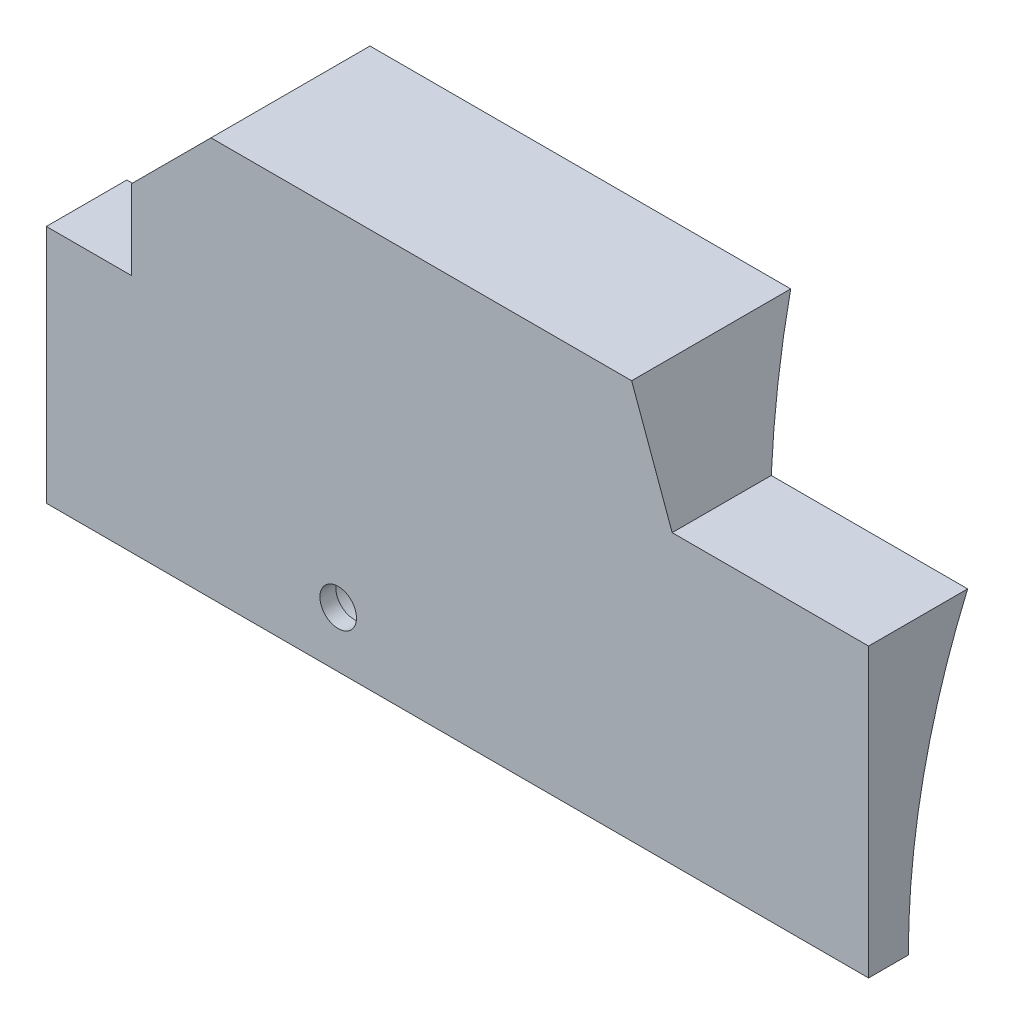
ISO-10303-21;
HEADER;
FILE_DESCRIPTION(('STEP AP214'),'2;1');
FILE_NAME('part.step','',(''),(''),'','','');
FILE_SCHEMA(('AUTOMOTIVE_DESIGN { 1 0 10303 214 1 1 1 1 }'));
ENDSEC;
DATA;
#1=APPLICATION_CONTEXT('core data for automotive mechanical design processes');
#2=APPLICATION_PROTOCOL_DEFINITION('international standard','automotive_design',2000,#1);
#3=PRODUCT_CONTEXT('',#1,'mechanical');
#4=PRODUCT('Part','Part','',(#3));
#5=PRODUCT_RELATED_PRODUCT_CATEGORY('part','',(#4));
#6=PRODUCT_DEFINITION_FORMATION('','',#4);
#7=PRODUCT_DEFINITION_CONTEXT('part definition',#1,'design');
#8=PRODUCT_DEFINITION('design','',#6,#7);
#9=PRODUCT_DEFINITION_SHAPE('','',#8);
#10=(LENGTH_UNIT() NAMED_UNIT(*) SI_UNIT(.MILLI.,.METRE.));
#11=(NAMED_UNIT(*) PLANE_ANGLE_UNIT() SI_UNIT($,.RADIAN.));
#12=(NAMED_UNIT(*) SI_UNIT($,.STERADIAN.) SOLID_ANGLE_UNIT());
#13=UNCERTAINTY_MEASURE_WITH_UNIT(LENGTH_MEASURE(1.E-05),#10,'distance_accuracy_value','');
#14=(GEOMETRIC_REPRESENTATION_CONTEXT(3) GLOBAL_UNCERTAINTY_ASSIGNED_CONTEXT((#13)) GLOBAL_UNIT_ASSIGNED_CONTEXT((#10,
#11,#12)) REPRESENTATION_CONTEXT('',''));
#15=CARTESIAN_POINT('',(0.,0.,0.));
#16=DIRECTION('',(0.,0.,1.));
#17=DIRECTION('',(1.,0.,0.));
#18=AXIS2_PLACEMENT_3D('',#15,#16,#17);
#19=CARTESIAN_POINT('',(19.999999999998,43.4250980548058,0.));
#20=DIRECTION('',(0.,0.,-1.));
#21=DIRECTION('',(1.,0.,0.));
#22=AXIS2_PLACEMENT_3D('',#19,#20,#21);
#23=CYLINDRICAL_SURFACE('',#22,1.15000000000313);
#24=CARTESIAN_POINT('',(19.999999999998,43.4250980548058,0.));
#25=DIRECTION('',(0.,0.,1.));
#26=DIRECTION('',(1.,0.,0.));
#27=AXIS2_PLACEMENT_3D('',#24,#25,#26);
#28=CIRCLE('',#27,1.15000000000313);
#29=CARTESIAN_POINT('',(21.1500000000011,43.4250980548058,0.));
#30=VERTEX_POINT('',#29);
#31=EDGE_CURVE('E240',#30,#30,#28,.T.);
#32=ORIENTED_EDGE('',*,*,#31,.T.);
#33=EDGE_LOOP('',(#32));
#34=FACE_BOUND('',#33,.T.);
#35=CARTESIAN_POINT('',(19.999999999998,43.4250980548058,-1.));
#36=DIRECTION('',(0.,0.,1.));
#37=DIRECTION('',(1.,0.,0.));
#38=AXIS2_PLACEMENT_3D('',#35,#36,#37);
#39=CIRCLE('',#38,1.15000000000313);
#40=CARTESIAN_POINT('',(21.1500000000011,43.4250980548058,-1.));
#41=VERTEX_POINT('',#40);
#42=EDGE_CURVE('E47',#41,#41,#39,.F.);
#43=ORIENTED_EDGE('',*,*,#42,.T.);
#44=EDGE_LOOP('',(#43));
#45=FACE_BOUND('',#44,.T.);
#46=ADVANCED_FACE('F43',(#34,#45),#23,.F.);
#47=CARTESIAN_POINT('',(1.6500000000003,39.9250980548054,-48.1667138374092));
#48=DIRECTION('',(1.,0.,0.));
#49=DIRECTION('',(0.,0.,1.));
#50=AXIS2_PLACEMENT_3D('',#47,#48,#49);
#51=CYLINDRICAL_SURFACE('',#50,45.6667138374092);
#52=CARTESIAN_POINT('',(47.578726295331,39.9250980548054,-48.1667138374092));
#53=DIRECTION('',(0.939692620785907,0.342020143325673,0.));
#54=DIRECTION('',(0.342020143325673,-0.939692620785907,0.));
#55=AXIS2_PLACEMENT_3D('',#52,#53,#54);
#56=ELLIPSE('',#55,48.5975018077892,45.6667138374092);
#57=CARTESIAN_POINT('',(38.4522083601362,65.0000000000003,-10.));
#58=VERTEX_POINT('',#57);
#59=CARTESIAN_POINT('',(40.9999999999997,58.0000000000003,-6.22930008334694));
#60=VERTEX_POINT('',#59);
#61=EDGE_CURVE('E197',#58,#60,#56,.T.);
#62=ORIENTED_EDGE('',*,*,#61,.T.);
#63=DIRECTION('',(1.,0.,0.));
#64=VECTOR('',#63,1.);
#65=CARTESIAN_POINT('',(1.65000000000039,58.0000000000005,-6.22930008334702));
#66=LINE('',#65,#64);
#67=CARTESIAN_POINT('',(53.3499999999999,58.0000000000002,-6.22930008334691));
#68=VERTEX_POINT('',#67);
#69=EDGE_CURVE('E194',#60,#68,#66,.T.);
#70=ORIENTED_EDGE('',*,*,#69,.T.);
#71=CARTESIAN_POINT('',(53.3499999999999,39.9250980548054,-48.1667138374092));
#72=DIRECTION('',(-1.,0.,0.));
#73=DIRECTION('',(0.,0.,-1.));
#74=AXIS2_PLACEMENT_3D('',#71,#72,#73);
#75=CIRCLE('',#74,45.6667138374092);
#76=CARTESIAN_POINT('',(53.3499999999999,39.9250980548059,-2.5));
#77=VERTEX_POINT('',#76);
#78=EDGE_CURVE('E219',#77,#68,#75,.T.);
#79=ORIENTED_EDGE('',*,*,#78,.F.);
#80=DIRECTION('',(1.,0.,0.));
#81=VECTOR('',#80,1.);
#82=CARTESIAN_POINT('',(1.6500000000003,39.9250980548059,-2.5));
#83=LINE('',#82,#81);
#84=CARTESIAN_POINT('',(1.6500000000003,39.9250980548059,-2.5));
#85=VERTEX_POINT('',#84);
#86=EDGE_CURVE('E221',#85,#77,#83,.T.);
#87=ORIENTED_EDGE('',*,*,#86,.F.);
#88=CARTESIAN_POINT('',(1.6500000000003,39.9250980548054,-48.1667138374092));
#89=DIRECTION('',(-1.,0.,0.));
#90=DIRECTION('',(0.,0.,-1.));
#91=AXIS2_PLACEMENT_3D('',#88,#89,#90);
#92=CIRCLE('',#91,45.6667138374092);
#93=CARTESIAN_POINT('',(1.6500000000003,55.0000000000001,-5.05991525469622));
#94=VERTEX_POINT('',#93);
#95=EDGE_CURVE('E118',#85,#94,#92,.T.);
#96=ORIENTED_EDGE('',*,*,#95,.T.);
#97=DIRECTION('',(1.,0.,0.));
#98=VECTOR('',#97,1.);
#99=CARTESIAN_POINT('',(1.65000000000011,55.0000000000001,-5.05991525469622));
#100=LINE('',#99,#98);
#101=CARTESIAN_POINT('',(6.99999999999924,55.0000000000001,-5.05991525469622));
#102=VERTEX_POINT('',#101);
#103=EDGE_CURVE('E222',#94,#102,#100,.T.);
#104=ORIENTED_EDGE('',*,*,#103,.T.);
#105=CARTESIAN_POINT('',(6.9999999999993,39.9250980548054,-48.1667138374092));
#106=DIRECTION('',(-1.,0.,0.));
#107=DIRECTION('',(0.,1.,0.));
#108=AXIS2_PLACEMENT_3D('',#105,#106,#107);
#109=CIRCLE('',#108,45.6667138374092);
#110=CARTESIAN_POINT('',(6.99999999999923,60.0000000000001,-7.14907050434291));
#111=VERTEX_POINT('',#110);
#112=EDGE_CURVE('E232',#102,#111,#109,.T.);
#113=ORIENTED_EDGE('',*,*,#112,.T.);
#114=CARTESIAN_POINT('',(-13.0749019451952,39.9250980548054,-48.1667138374092));
#115=DIRECTION('',(-0.707106781186552,0.707106781186543,0.));
#116=DIRECTION('',(0.707106781186543,0.707106781186552,0.));
#117=AXIS2_PLACEMENT_3D('',#114,#115,#116);
#118=ELLIPSE('',#117,64.5824860578748,45.6667138374092);
#119=CARTESIAN_POINT('',(11.9999999999992,65.0000000000003,-10.));
#120=VERTEX_POINT('',#119);
#121=EDGE_CURVE('E235',#111,#120,#118,.T.);
#122=ORIENTED_EDGE('',*,*,#121,.T.);
#123=DIRECTION('',(-1.,0.,0.));
#124=VECTOR('',#123,1.);
#125=CARTESIAN_POINT('',(38.4522083601362,65.0000000000003,-10.));
#126=LINE('',#125,#124);
#127=EDGE_CURVE('E105',#58,#120,#126,.T.);
#128=ORIENTED_EDGE('',*,*,#127,.F.);
#129=EDGE_LOOP('',(#62,#70,#79,#87,#96,#104,#113,#122,#128));
#130=FACE_BOUND('',#129,.T.);
#131=CARTESIAN_POINT('',(17.9499999999963,43.4250980548061,-2.6343214918733));
#132=CARTESIAN_POINT('',(17.9500050023373,43.3100084166059,-2.62547535582466));
#133=CARTESIAN_POINT('',(17.9597237788177,43.1948045627664,-2.61706281856671));
#134=CARTESIAN_POINT('',(17.9983947787586,42.9675002376139,-2.60131508514162));
#135=CARTESIAN_POINT('',(18.027368974417,42.8554034641616,-2.59398113142669));
#136=CARTESIAN_POINT('',(18.1037642605047,42.63763754753,-2.5805012212643));
#137=CARTESIAN_POINT('',(18.1511789861406,42.5319662011351,-2.57435485601223));
#138=CARTESIAN_POINT('',(18.263119527637,42.3300787945935,-2.56325941946487));
#139=CARTESIAN_POINT('',(18.3276412196049,42.2338604633062,-2.55831006016233));
#140=CARTESIAN_POINT('',(18.4718455436148,42.0537753901684,-2.5495502592139));
#141=CARTESIAN_POINT('',(18.5515006309596,41.9698866913654,-2.54573778020532));
#142=CARTESIAN_POINT('',(18.7237924855824,41.8166559784288,-2.53912723959167));
#143=CARTESIAN_POINT('',(18.8164296630677,41.7473144241279,-2.53632921005114));
#144=CARTESIAN_POINT('',(19.0119453773351,41.6252323285552,-2.53161727526276));
#145=CARTESIAN_POINT('',(19.114812878109,41.5724741482005,-2.52970242958649));
#146=CARTESIAN_POINT('',(19.3279513209648,41.48496351137,-2.52662728256245));
#147=CARTESIAN_POINT('',(19.4382222420517,41.4502110038353,-2.52546697907501));
#148=CARTESIAN_POINT('',(19.6630259012623,41.3997044780883,-2.52380711738491));
#149=CARTESIAN_POINT('',(19.7775582301307,41.3839486403123,-2.52330749589949));
#150=CARTESIAN_POINT('',(20.0076436738459,41.3718779478733,-2.52292325419183));
#151=CARTESIAN_POINT('',(20.1231967873756,41.3755630681305,-2.5230386331762));
#152=CARTESIAN_POINT('',(20.3520515131573,41.4022702073359,-2.52389523529696));
#153=CARTESIAN_POINT('',(20.4653529815439,41.4252934578238,-2.52463649829249));
#154=CARTESIAN_POINT('',(20.6864803342494,41.49002272825,-2.52681020674958));
#155=CARTESIAN_POINT('',(20.7943062164759,41.5317287553274,-2.52824265247525));
#156=CARTESIAN_POINT('',(21.0014174249196,41.6326327671409,-2.53190679454866));
#157=CARTESIAN_POINT('',(21.1007030456691,41.6918301483314,-2.53413846331947));
#158=CARTESIAN_POINT('',(21.2879198350759,41.8260273329879,-2.53953208434279));
#159=CARTESIAN_POINT('',(21.3758510362134,41.9010270912484,-2.54269403393408));
#160=CARTESIAN_POINT('',(21.5378648792576,42.064683004535,-2.55007628101035));
#161=CARTESIAN_POINT('',(21.6119479554051,42.1533387311869,-2.55429654529966));
#162=CARTESIAN_POINT('',(21.7441776905135,42.3417733780478,-2.56389245639614));
#163=CARTESIAN_POINT('',(21.8023243575221,42.4415522926398,-2.56926810261986));
#164=CARTESIAN_POINT('',(21.9010810078951,42.6494426620068,-2.58121687847711));
#165=CARTESIAN_POINT('',(21.941681135163,42.7575587598022,-2.58779067818787));
#166=CARTESIAN_POINT('',(22.0041773645385,42.9789943637642,-2.60209190463339));
#167=CARTESIAN_POINT('',(22.0260732911154,43.0923139187525,-2.60981934219375));
#168=CARTESIAN_POINT('',(22.0506032150165,43.3211800957494,-2.6263079802929));
#169=CARTESIAN_POINT('',(22.0531976874159,43.4367308020966,-2.63507126477244));
#170=CARTESIAN_POINT('',(22.0389824419626,43.6665696116696,-2.65338132199114));
#171=CARTESIAN_POINT('',(22.0221723104421,43.7808576879261,-2.66292811142905));
#172=CARTESIAN_POINT('',(21.9695584796998,44.0053327817185,-2.68250582505099));
#173=CARTESIAN_POINT('',(21.9336923400187,44.1155050353694,-2.69253824168283));
#174=CARTESIAN_POINT('',(21.8439487491928,44.3282492944363,-2.71264427273186));
#175=CARTESIAN_POINT('',(21.7900709631021,44.4308211584715,-2.72271788791173));
#176=CARTESIAN_POINT('',(21.6656828886919,44.6256762386579,-2.74245885439935));
#177=CARTESIAN_POINT('',(21.5951384789676,44.7179377680751,-2.75212532367861));
#178=CARTESIAN_POINT('',(21.4394503261221,44.8892985632345,-2.77053659645865));
#179=CARTESIAN_POINT('',(21.3543066751185,44.9683979120208,-2.77928140577431));
#180=CARTESIAN_POINT('',(21.1720080654509,45.1109983918766,-2.79535344888935));
#181=CARTESIAN_POINT('',(21.0748793841133,45.1745327667451,-2.80268369667963));
#182=CARTESIAN_POINT('',(20.8712116393528,45.2843652879601,-2.81552775788553));
#183=CARTESIAN_POINT('',(20.7646729285357,45.3306640798072,-2.82104163932613));
#184=CARTESIAN_POINT('',(20.5459041784511,45.4044243247551,-2.82989527519737));
#185=CARTESIAN_POINT('',(20.4337129071209,45.4319991889518,-2.83324811270189));
#186=CARTESIAN_POINT('',(20.206251530292,45.4679432730839,-2.83762876851246));
#187=CARTESIAN_POINT('',(20.0909815336902,45.4763131714062,-2.83865666894344));
#188=CARTESIAN_POINT('',(19.8613062804637,45.4736053598758,-2.83832516219519));
#189=CARTESIAN_POINT('',(19.7468997396007,45.4626336266091,-2.83697876424821));
#190=CARTESIAN_POINT('',(19.5215688033796,45.4217738963324,-2.83200610448911));
#191=CARTESIAN_POINT('',(19.410644396446,45.3918859622116,-2.82837985025666));
#192=CARTESIAN_POINT('',(19.1954081353071,45.3140734253813,-2.81906536595051));
#193=CARTESIAN_POINT('',(19.0910963286677,45.266148692946,-2.81337712104642));
#194=CARTESIAN_POINT('',(18.8919978163513,45.1536539457089,-2.8002708545562));
#195=CARTESIAN_POINT('',(18.7972110147522,45.0890840985558,-2.79285285039219));
#196=CARTESIAN_POINT('',(18.6192994060538,44.9447548880675,-2.77665892952218));
#197=CARTESIAN_POINT('',(18.5362392703513,44.8649166047775,-2.76787600402988));
#198=CARTESIAN_POINT('',(18.3846542831782,44.6925112074637,-2.74944812359641));
#199=CARTESIAN_POINT('',(18.3161334740467,44.5999405652486,-2.73980292997724));
#200=CARTESIAN_POINT('',(18.1951429586218,44.4040448818835,-2.7200688997874));
#201=CARTESIAN_POINT('',(18.1427820334092,44.3006529733375,-2.70997755794849));
#202=CARTESIAN_POINT('',(18.0562411661085,44.0866102824108,-2.68988373193522));
#203=CARTESIAN_POINT('',(18.0220402578851,43.9759680372975,-2.67988115845828));
#204=CARTESIAN_POINT('',(17.9816457315036,43.791398520619,-2.66390390152999));
#205=CARTESIAN_POINT('',(17.9697957829529,43.7186729629425,-2.65778142006822));
#206=CARTESIAN_POINT('',(17.9539713078297,43.5723465465405,-2.64582060423375));
#207=CARTESIAN_POINT('',(17.9499967989213,43.498745685852,-2.63998227049838));
#208=CARTESIAN_POINT('',(17.9499999999963,43.4250980548061,-2.6343214918733));
#209=B_SPLINE_CURVE_WITH_KNOTS('',3,(#131,#132,#133,#134,#135,#136,#137,#138,#139,#140,#141,
#142,#143,#144,#145,#146,#147,#148,#149,#150,#151,#152,#153,#154,#155,#156,#157,#158,#159,#160,
#161,#162,#163,#164,#165,#166,#167,#168,#169,#170,#171,#172,#173,#174,#175,#176,#177,#178,#179,
#180,#181,#182,#183,#184,#185,#186,#187,#188,#189,#190,#191,#192,#193,#194,#195,#196,#197,#198,
#199,#200,#201,#202,#203,#204,#205,#206,#207,#208),.UNSPECIFIED.,.T.,.F.,(4,2,2,2,2,2,2,2,2,2,2,
2,2,2,2,2,2,2,2,2,2,2,2,2,2,2,2,2,2,2,2,2,2,2,2,2,2,2,4),(0.,0.346019044668169,
0.692433608286428,1.03872871204062,1.38494041191405,1.7305278971645,2.0761263047326,
2.42135585909985,2.76658443448908,3.11177994011739,3.4569750004245,3.80219204598218,
4.14740922345405,4.49261449046919,4.83781876997521,5.18301222296668,5.52820550164098,
5.87359242819813,6.21898259602738,6.56507984905306,6.91118448032516,7.25843024415765,
7.6056824657604,7.95365186974375,8.30161907820564,8.64883648622958,8.99604088908748,
9.34112304857538,9.68619301836013,10.0293781544108,10.3725621495065,10.7157486129248,
11.0589316199224,11.4039389220374,11.7490420205002,12.0964199302148,12.4433959077125,
12.6648183239918,12.8862412369064),.UNSPECIFIED.);
#210=CARTESIAN_POINT('',(17.9499999999963,43.4250980548061,-2.6343214918733));
#211=VERTEX_POINT('',#210);
#212=EDGE_CURVE('E136',#211,#211,#209,.T.);
#213=ORIENTED_EDGE('',*,*,#212,.T.);
#214=EDGE_LOOP('',(#213));
#215=FACE_BOUND('',#214,.T.);
#216=ADVANCED_FACE('F147',(#130,#215),#51,.F.);
#217=CARTESIAN_POINT('',(53.3499999999999,46.9250980548054,-10.));
#218=DIRECTION('',(-1.,0.,0.));
#219=DIRECTION('',(0.,0.,-1.));
#220=AXIS2_PLACEMENT_3D('',#217,#218,#219);
#221=PLANE('',#220);
#222=DIRECTION('',(0.,0.,1.));
#223=VECTOR('',#222,1.);
#224=CARTESIAN_POINT('',(53.3499999999999,58.0000000000002,-10.));
#225=LINE('',#224,#223);
#226=CARTESIAN_POINT('',(53.3499999999999,58.0000000000002,0.));
#227=VERTEX_POINT('',#226);
#228=EDGE_CURVE('E11',#68,#227,#225,.T.);
#229=ORIENTED_EDGE('',*,*,#228,.T.);
#230=DIRECTION('',(0.,1.,0.));
#231=VECTOR('',#230,1.);
#232=CARTESIAN_POINT('',(53.3499999999999,46.9250980548054,0.));
#233=LINE('',#232,#231);
#234=CARTESIAN_POINT('',(53.3499999999999,39.9250980548054,0.));
#235=VERTEX_POINT('',#234);
#236=EDGE_CURVE('E220',#235,#227,#233,.T.);
#237=ORIENTED_EDGE('',*,*,#236,.F.);
#238=DIRECTION('',(0.,0.,1.));
#239=VECTOR('',#238,1.);
#240=CARTESIAN_POINT('',(53.3499999999999,39.9250980548054,-10.));
#241=LINE('',#240,#239);
#242=EDGE_CURVE('E101',#77,#235,#241,.T.);
#243=ORIENTED_EDGE('',*,*,#242,.F.);
#244=ORIENTED_EDGE('',*,*,#78,.T.);
#245=EDGE_LOOP('',(#229,#237,#243,#244));
#246=FACE_BOUND('',#245,.T.);
#247=ADVANCED_FACE('F45',(#246),#221,.F.);
#248=CARTESIAN_POINT('',(53.3499999999999,58.0000000000002,-10.));
#249=DIRECTION('',(0.,-1.,0.));
#250=DIRECTION('',(1.,0.,0.));
#251=AXIS2_PLACEMENT_3D('',#248,#249,#250);
#252=PLANE('',#251);
#253=DIRECTION('',(0.,0.,1.));
#254=VECTOR('',#253,1.);
#255=CARTESIAN_POINT('',(40.9999999999997,58.0000000000003,-10.));
#256=LINE('',#255,#254);
#257=CARTESIAN_POINT('',(40.9999999999997,58.0000000000003,0.));
#258=VERTEX_POINT('',#257);
#259=EDGE_CURVE('E53',#60,#258,#256,.T.);
#260=ORIENTED_EDGE('',*,*,#259,.T.);
#261=DIRECTION('',(-1.,0.,0.));
#262=VECTOR('',#261,1.);
#263=CARTESIAN_POINT('',(53.3499999999999,58.0000000000002,0.));
#264=LINE('',#263,#262);
#265=EDGE_CURVE('E192',#227,#258,#264,.T.);
#266=ORIENTED_EDGE('',*,*,#265,.F.);
#267=ORIENTED_EDGE('',*,*,#228,.F.);
#268=ORIENTED_EDGE('',*,*,#69,.F.);
#269=EDGE_LOOP('',(#260,#266,#267,#268));
#270=FACE_BOUND('',#269,.T.);
#271=ADVANCED_FACE('F180',(#270),#252,.F.);
#272=CARTESIAN_POINT('',(40.9999999999997,58.0000000000003,-10.));
#273=DIRECTION('',(-0.939692620785907,-0.342020143325673,0.));
#274=DIRECTION('',(0.342020143325673,-0.939692620785907,0.));
#275=AXIS2_PLACEMENT_3D('',#272,#273,#274);
#276=PLANE('',#275);
#277=DIRECTION('',(0.,0.,1.));
#278=VECTOR('',#277,1.);
#279=CARTESIAN_POINT('',(38.4522083601362,65.0000000000003,-10.));
#280=LINE('',#279,#278);
#281=CARTESIAN_POINT('',(38.4522083601362,65.0000000000003,0.));
#282=VERTEX_POINT('',#281);
#283=EDGE_CURVE('E61',#58,#282,#280,.T.);
#284=ORIENTED_EDGE('',*,*,#283,.T.);
#285=DIRECTION('',(-0.342020143325673,0.939692620785907,0.));
#286=VECTOR('',#285,1.);
#287=CARTESIAN_POINT('',(40.9999999999997,58.0000000000003,0.));
#288=LINE('',#287,#286);
#289=EDGE_CURVE('E199',#258,#282,#288,.T.);
#290=ORIENTED_EDGE('',*,*,#289,.F.);
#291=ORIENTED_EDGE('',*,*,#259,.F.);
#292=ORIENTED_EDGE('',*,*,#61,.F.);
#293=EDGE_LOOP('',(#284,#290,#291,#292));
#294=FACE_BOUND('',#293,.T.);
#295=ADVANCED_FACE('F178',(#294),#276,.F.);
#296=CARTESIAN_POINT('',(38.4522083601362,65.0000000000003,-10.));
#297=DIRECTION('',(0.,-1.,0.));
#298=DIRECTION('',(1.,0.,0.));
#299=AXIS2_PLACEMENT_3D('',#296,#297,#298);
#300=PLANE('',#299);
#301=DIRECTION('',(-1.,0.,0.));
#302=VECTOR('',#301,1.);
#303=CARTESIAN_POINT('',(38.4522083601362,65.0000000000003,0.));
#304=LINE('',#303,#302);
#305=CARTESIAN_POINT('',(11.9999999999992,65.0000000000002,0.));
#306=VERTEX_POINT('',#305);
#307=EDGE_CURVE('E247',#282,#306,#304,.T.);
#308=ORIENTED_EDGE('',*,*,#307,.F.);
#309=ORIENTED_EDGE('',*,*,#283,.F.);
#310=ORIENTED_EDGE('',*,*,#127,.T.);
#311=DIRECTION('',(0.,0.,1.));
#312=VECTOR('',#311,1.);
#313=CARTESIAN_POINT('',(11.9999999999992,65.0000000000002,-10.));
#314=LINE('',#313,#312);
#315=EDGE_CURVE('E131',#120,#306,#314,.T.);
#316=ORIENTED_EDGE('',*,*,#315,.T.);
#317=EDGE_LOOP('',(#308,#309,#310,#316));
#318=FACE_BOUND('',#317,.T.);
#319=ADVANCED_FACE('F174',(#318),#300,.F.);
#320=CARTESIAN_POINT('',(11.9999999999992,65.0000000000002,-10.));
#321=DIRECTION('',(0.707106781186552,-0.707106781186543,0.));
#322=DIRECTION('',(0.707106781186543,0.707106781186552,0.));
#323=AXIS2_PLACEMENT_3D('',#320,#321,#322);
#324=PLANE('',#323);
#325=DIRECTION('',(0.,0.,1.));
#326=VECTOR('',#325,1.);
#327=CARTESIAN_POINT('',(6.99999999999923,60.0000000000001,-10.));
#328=LINE('',#327,#326);
#329=CARTESIAN_POINT('',(6.99999999999923,60.0000000000001,0.));
#330=VERTEX_POINT('',#329);
#331=EDGE_CURVE('E128',#111,#330,#328,.T.);
#332=ORIENTED_EDGE('',*,*,#331,.T.);
#333=DIRECTION('',(-0.707106781186543,-0.707106781186552,0.));
#334=VECTOR('',#333,1.);
#335=CARTESIAN_POINT('',(11.9999999999992,65.0000000000002,0.));
#336=LINE('',#335,#334);
#337=EDGE_CURVE('E250',#306,#330,#336,.T.);
#338=ORIENTED_EDGE('',*,*,#337,.F.);
#339=ORIENTED_EDGE('',*,*,#315,.F.);
#340=ORIENTED_EDGE('',*,*,#121,.F.);
#341=EDGE_LOOP('',(#332,#338,#339,#340));
#342=FACE_BOUND('',#341,.T.);
#343=ADVANCED_FACE('F170',(#342),#324,.F.);
#344=CARTESIAN_POINT('',(6.99999999999923,60.0000000000001,-10.));
#345=DIRECTION('',(1.,0.,0.));
#346=DIRECTION('',(0.,1.,0.));
#347=AXIS2_PLACEMENT_3D('',#344,#345,#346);
#348=PLANE('',#347);
#349=DIRECTION('',(0.,0.,1.));
#350=VECTOR('',#349,1.);
#351=CARTESIAN_POINT('',(6.99999999999924,55.0000000000001,-10.));
#352=LINE('',#351,#350);
#353=CARTESIAN_POINT('',(6.99999999999924,55.0000000000001,0.));
#354=VERTEX_POINT('',#353);
#355=EDGE_CURVE('E122',#102,#354,#352,.T.);
#356=ORIENTED_EDGE('',*,*,#355,.T.);
#357=DIRECTION('',(0.,-1.,0.));
#358=VECTOR('',#357,1.);
#359=CARTESIAN_POINT('',(6.99999999999923,60.0000000000001,0.));
#360=LINE('',#359,#358);
#361=EDGE_CURVE('E253',#330,#354,#360,.T.);
#362=ORIENTED_EDGE('',*,*,#361,.F.);
#363=ORIENTED_EDGE('',*,*,#331,.F.);
#364=ORIENTED_EDGE('',*,*,#112,.F.);
#365=EDGE_LOOP('',(#356,#362,#363,#364));
#366=FACE_BOUND('',#365,.T.);
#367=ADVANCED_FACE('F166',(#366),#348,.F.);
#368=CARTESIAN_POINT('',(6.99999999999924,55.0000000000001,-10.));
#369=DIRECTION('',(0.,-1.,0.));
#370=DIRECTION('',(1.,0.,0.));
#371=AXIS2_PLACEMENT_3D('',#368,#369,#370);
#372=PLANE('',#371);
#373=DIRECTION('',(0.,0.,1.));
#374=VECTOR('',#373,1.);
#375=CARTESIAN_POINT('',(1.6500000000003,55.0000000000001,-10.));
#376=LINE('',#375,#374);
#377=CARTESIAN_POINT('',(1.6500000000003,55.0000000000001,0.));
#378=VERTEX_POINT('',#377);
#379=EDGE_CURVE('E120',#94,#378,#376,.T.);
#380=ORIENTED_EDGE('',*,*,#379,.T.);
#381=DIRECTION('',(-1.,0.,0.));
#382=VECTOR('',#381,1.);
#383=CARTESIAN_POINT('',(6.99999999999924,55.0000000000001,0.));
#384=LINE('',#383,#382);
#385=EDGE_CURVE('E111',#354,#378,#384,.T.);
#386=ORIENTED_EDGE('',*,*,#385,.F.);
#387=ORIENTED_EDGE('',*,*,#355,.F.);
#388=ORIENTED_EDGE('',*,*,#103,.F.);
#389=EDGE_LOOP('',(#380,#386,#387,#388));
#390=FACE_BOUND('',#389,.T.);
#391=ADVANCED_FACE('F163',(#390),#372,.F.);
#392=CARTESIAN_POINT('',(1.6500000000003,39.9250980548054,-10.));
#393=DIRECTION('',(1.,0.,0.));
#394=DIRECTION('',(0.,1.,0.));
#395=AXIS2_PLACEMENT_3D('',#392,#393,#394);
#396=PLANE('',#395);
#397=DIRECTION('',(0.,0.,1.));
#398=VECTOR('',#397,1.);
#399=CARTESIAN_POINT('',(1.6500000000003,39.9250980548054,-10.));
#400=LINE('',#399,#398);
#401=CARTESIAN_POINT('',(1.6500000000003,39.9250980548054,0.));
#402=VERTEX_POINT('',#401);
#403=EDGE_CURVE('E98',#85,#402,#400,.T.);
#404=ORIENTED_EDGE('',*,*,#403,.T.);
#405=DIRECTION('',(0.,-1.,0.));
#406=VECTOR('',#405,1.);
#407=CARTESIAN_POINT('',(1.6500000000003,39.9250980548054,0.));
#408=LINE('',#407,#406);
#409=EDGE_CURVE('E106',#378,#402,#408,.T.);
#410=ORIENTED_EDGE('',*,*,#409,.F.);
#411=ORIENTED_EDGE('',*,*,#379,.F.);
#412=ORIENTED_EDGE('',*,*,#95,.F.);
#413=EDGE_LOOP('',(#404,#410,#411,#412));
#414=FACE_BOUND('',#413,.T.);
#415=ADVANCED_FACE('F116',(#414),#396,.F.);
#416=CARTESIAN_POINT('',(53.3499999999999,39.9250980548054,-10.));
#417=DIRECTION('',(0.,1.,0.));
#418=DIRECTION('',(0.,0.,-1.));
#419=AXIS2_PLACEMENT_3D('',#416,#417,#418);
#420=PLANE('',#419);
#421=ORIENTED_EDGE('',*,*,#242,.T.);
#422=DIRECTION('',(1.,0.,0.));
#423=VECTOR('',#422,1.);
#424=CARTESIAN_POINT('',(53.3499999999999,39.9250980548054,0.));
#425=LINE('',#424,#423);
#426=EDGE_CURVE('E92',#402,#235,#425,.T.);
#427=ORIENTED_EDGE('',*,*,#426,.F.);
#428=ORIENTED_EDGE('',*,*,#403,.F.);
#429=ORIENTED_EDGE('',*,*,#86,.T.);
#430=EDGE_LOOP('',(#421,#427,#428,#429));
#431=FACE_BOUND('',#430,.T.);
#432=ADVANCED_FACE('F94',(#431),#420,.F.);
#433=CARTESIAN_POINT('',(0.,0.,0.));
#434=DIRECTION('',(0.,0.,-1.));
#435=DIRECTION('',(1.,0.,0.));
#436=AXIS2_PLACEMENT_3D('',#433,#434,#435);
#437=PLANE('',#436);
#438=ORIENTED_EDGE('',*,*,#31,.F.);
#439=EDGE_LOOP('',(#438));
#440=FACE_BOUND('',#439,.T.);
#441=ORIENTED_EDGE('',*,*,#236,.T.);
#442=ORIENTED_EDGE('',*,*,#265,.T.);
#443=ORIENTED_EDGE('',*,*,#289,.T.);
#444=ORIENTED_EDGE('',*,*,#307,.T.);
#445=ORIENTED_EDGE('',*,*,#337,.T.);
#446=ORIENTED_EDGE('',*,*,#361,.T.);
#447=ORIENTED_EDGE('',*,*,#385,.T.);
#448=ORIENTED_EDGE('',*,*,#409,.T.);
#449=ORIENTED_EDGE('',*,*,#426,.T.);
#450=EDGE_LOOP('',(#441,#442,#443,#444,#445,#446,#447,#448,#449));
#451=FACE_BOUND('',#450,.T.);
#452=ADVANCED_FACE('F109',(#440,#451),#437,.F.);
#453=CARTESIAN_POINT('',(19.9999999999989,43.4250980548061,-1.));
#454=DIRECTION('',(0.,0.,-1.));
#455=DIRECTION('',(1.,0.,0.));
#456=AXIS2_PLACEMENT_3D('',#453,#454,#455);
#457=PLANE('',#456);
#458=CARTESIAN_POINT('',(19.9999999999989,43.4250980548061,-1.));
#459=DIRECTION('',(0.,0.,1.));
#460=DIRECTION('',(1.,0.,0.));
#461=AXIS2_PLACEMENT_3D('',#458,#459,#460);
#462=CIRCLE('',#461,2.05000000000254);
#463=CARTESIAN_POINT('',(22.0500000000014,43.4250980548061,-1.));
#464=VERTEX_POINT('',#463);
#465=EDGE_CURVE('E143',#464,#464,#462,.T.);
#466=ORIENTED_EDGE('',*,*,#465,.F.);
#467=EDGE_LOOP('',(#466));
#468=FACE_BOUND('',#467,.T.);
#469=ORIENTED_EDGE('',*,*,#42,.F.);
#470=EDGE_LOOP('',(#469));
#471=FACE_BOUND('',#470,.T.);
#472=ADVANCED_FACE('F157',(#468,#471),#457,.T.);
#473=CARTESIAN_POINT('',(19.9999999999989,43.4250980548061,-10.));
#474=DIRECTION('',(0.,0.,1.));
#475=DIRECTION('',(-1.,0.,0.));
#476=AXIS2_PLACEMENT_3D('',#473,#474,#475);
#477=CYLINDRICAL_SURFACE('',#476,2.05000000000254);
#478=ORIENTED_EDGE('',*,*,#465,.T.);
#479=EDGE_LOOP('',(#478));
#480=FACE_BOUND('',#479,.T.);
#481=ORIENTED_EDGE('',*,*,#212,.F.);
#482=EDGE_LOOP('',(#481));
#483=FACE_BOUND('',#482,.T.);
#484=ADVANCED_FACE('F144',(#480,#483),#477,.F.);
#485=CLOSED_SHELL('',(#46,#216,#247,#271,#295,#319,#343,#367,#391,#415,#432,#452,#472,#484));
#486=MANIFOLD_SOLID_BREP('B2',#485);
#487=ADVANCED_BREP_SHAPE_REPRESENTATION('',(#18,#486),#14);
#488=SHAPE_DEFINITION_REPRESENTATION(#9,#487);
ENDSEC;
END-ISO-10303-21;
